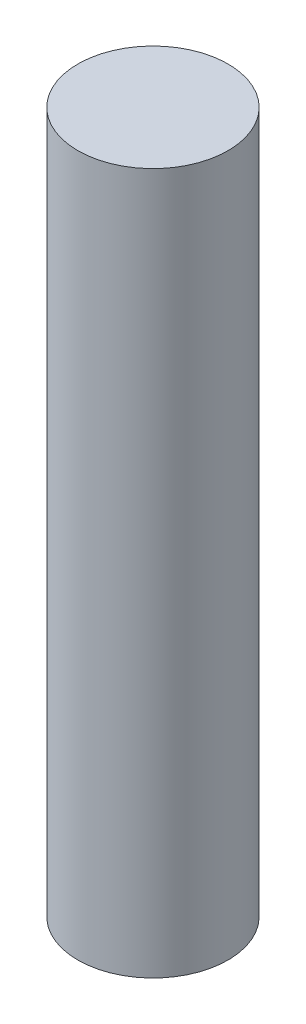
ISO-10303-21;
HEADER;
FILE_DESCRIPTION(('STEP AP214'),'2;1');
FILE_NAME('part.step','',(''),(''),'','','');
FILE_SCHEMA(('AUTOMOTIVE_DESIGN { 1 0 10303 214 1 1 1 1 }'));
ENDSEC;
DATA;
#1=APPLICATION_CONTEXT('core data for automotive mechanical design processes');
#2=APPLICATION_PROTOCOL_DEFINITION('international standard','automotive_design',2000,#1);
#3=PRODUCT_CONTEXT('',#1,'mechanical');
#4=PRODUCT('Part','Part','',(#3));
#5=PRODUCT_RELATED_PRODUCT_CATEGORY('part','',(#4));
#6=PRODUCT_DEFINITION_FORMATION('','',#4);
#7=PRODUCT_DEFINITION_CONTEXT('part definition',#1,'design');
#8=PRODUCT_DEFINITION('design','',#6,#7);
#9=PRODUCT_DEFINITION_SHAPE('','',#8);
#10=(LENGTH_UNIT() NAMED_UNIT(*) SI_UNIT(.MILLI.,.METRE.));
#11=(NAMED_UNIT(*) PLANE_ANGLE_UNIT() SI_UNIT($,.RADIAN.));
#12=(NAMED_UNIT(*) SI_UNIT($,.STERADIAN.) SOLID_ANGLE_UNIT());
#13=UNCERTAINTY_MEASURE_WITH_UNIT(LENGTH_MEASURE(1.E-05),#10,'distance_accuracy_value','');
#14=(GEOMETRIC_REPRESENTATION_CONTEXT(3) GLOBAL_UNCERTAINTY_ASSIGNED_CONTEXT((#13)) GLOBAL_UNIT_ASSIGNED_CONTEXT((#10,
#11,#12)) REPRESENTATION_CONTEXT('',''));
#15=CARTESIAN_POINT('',(0.,0.,0.));
#16=DIRECTION('',(0.,0.,1.));
#17=DIRECTION('',(1.,0.,0.));
#18=AXIS2_PLACEMENT_3D('',#15,#16,#17);
#19=CARTESIAN_POINT('',(0.,70.,0.));
#20=DIRECTION('',(0.,-1.,0.));
#21=DIRECTION('',(0.,0.,-1.));
#22=AXIS2_PLACEMENT_3D('',#19,#20,#21);
#23=CYLINDRICAL_SURFACE('',#22,7.5);
#24=CARTESIAN_POINT('',(0.,70.,0.));
#25=DIRECTION('',(0.,1.,0.));
#26=DIRECTION('',(0.,0.,1.));
#27=AXIS2_PLACEMENT_3D('',#24,#25,#26);
#28=CIRCLE('',#27,7.5);
#29=CARTESIAN_POINT('',(0.,70.,7.5));
#30=VERTEX_POINT('',#29);
#31=EDGE_CURVE('E10',#30,#30,#28,.T.);
#32=ORIENTED_EDGE('',*,*,#31,.F.);
#33=EDGE_LOOP('',(#32));
#34=FACE_BOUND('',#33,.T.);
#35=CARTESIAN_POINT('',(0.,0.,0.));
#36=DIRECTION('',(0.,1.,0.));
#37=DIRECTION('',(0.,0.,1.));
#38=AXIS2_PLACEMENT_3D('',#35,#36,#37);
#39=CIRCLE('',#38,7.5);
#40=CARTESIAN_POINT('',(0.,0.,7.5));
#41=VERTEX_POINT('',#40);
#42=EDGE_CURVE('E40',#41,#41,#39,.T.);
#43=ORIENTED_EDGE('',*,*,#42,.T.);
#44=EDGE_LOOP('',(#43));
#45=FACE_BOUND('',#44,.T.);
#46=ADVANCED_FACE('F37',(#34,#45),#23,.T.);
#47=CARTESIAN_POINT('',(0.,70.,0.));
#48=DIRECTION('',(0.,1.,0.));
#49=DIRECTION('',(0.,0.,1.));
#50=AXIS2_PLACEMENT_3D('',#47,#48,#49);
#51=PLANE('',#50);
#52=ORIENTED_EDGE('',*,*,#31,.T.);
#53=EDGE_LOOP('',(#52));
#54=FACE_BOUND('',#53,.T.);
#55=ADVANCED_FACE('F54',(#54),#51,.T.);
#56=CARTESIAN_POINT('',(0.,0.,0.));
#57=DIRECTION('',(0.,1.,0.));
#58=DIRECTION('',(0.,0.,1.));
#59=AXIS2_PLACEMENT_3D('',#56,#57,#58);
#60=PLANE('',#59);
#61=ORIENTED_EDGE('',*,*,#42,.F.);
#62=EDGE_LOOP('',(#61));
#63=FACE_BOUND('',#62,.T.);
#64=ADVANCED_FACE('F52',(#63),#60,.F.);
#65=CLOSED_SHELL('',(#46,#55,#64));
#66=MANIFOLD_SOLID_BREP('B2',#65);
#67=ADVANCED_BREP_SHAPE_REPRESENTATION('',(#18,#66),#14);
#68=SHAPE_DEFINITION_REPRESENTATION(#9,#67);
ENDSEC;
END-ISO-10303-21;
